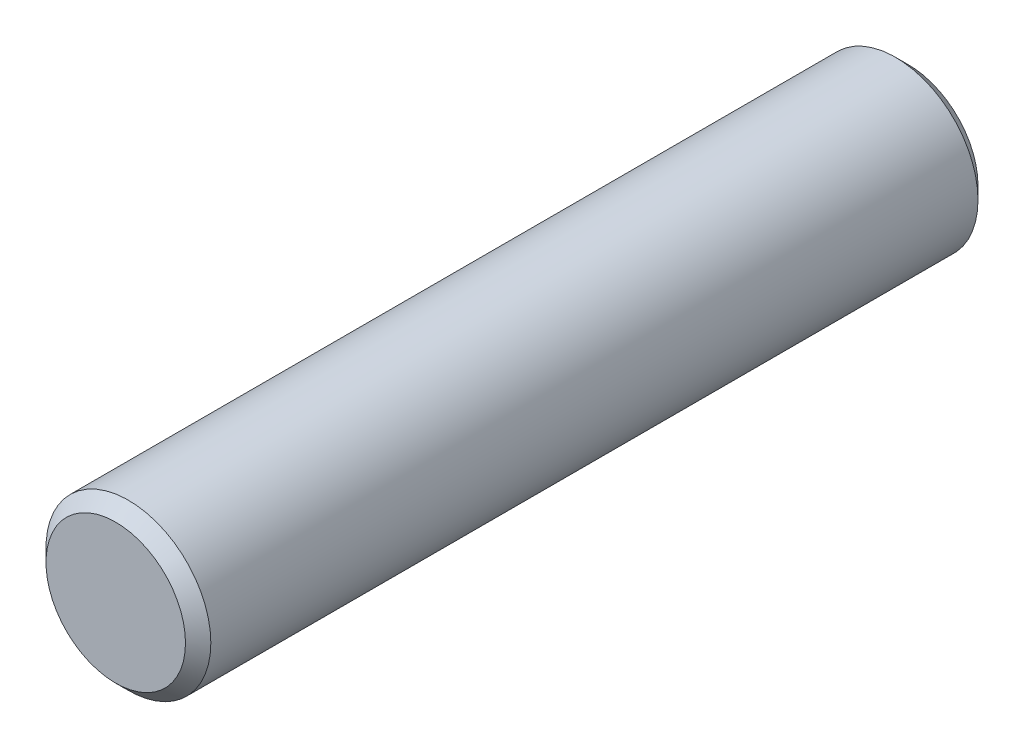
ISO-10303-21;
HEADER;
FILE_DESCRIPTION(('STEP AP214'),'2;1');
FILE_NAME('part.step','',(''),(''),'','','');
FILE_SCHEMA(('AUTOMOTIVE_DESIGN { 1 0 10303 214 1 1 1 1 }'));
ENDSEC;
DATA;
#1=APPLICATION_CONTEXT('core data for automotive mechanical design processes');
#2=APPLICATION_PROTOCOL_DEFINITION('international standard','automotive_design',2000,#1);
#3=PRODUCT_CONTEXT('',#1,'mechanical');
#4=PRODUCT('Part','Part','',(#3));
#5=PRODUCT_RELATED_PRODUCT_CATEGORY('part','',(#4));
#6=PRODUCT_DEFINITION_FORMATION('','',#4);
#7=PRODUCT_DEFINITION_CONTEXT('part definition',#1,'design');
#8=PRODUCT_DEFINITION('design','',#6,#7);
#9=PRODUCT_DEFINITION_SHAPE('','',#8);
#10=(LENGTH_UNIT() NAMED_UNIT(*) SI_UNIT(.MILLI.,.METRE.));
#11=(NAMED_UNIT(*) PLANE_ANGLE_UNIT() SI_UNIT($,.RADIAN.));
#12=(NAMED_UNIT(*) SI_UNIT($,.STERADIAN.) SOLID_ANGLE_UNIT());
#13=UNCERTAINTY_MEASURE_WITH_UNIT(LENGTH_MEASURE(1.E-05),#10,'distance_accuracy_value','');
#14=(GEOMETRIC_REPRESENTATION_CONTEXT(3) GLOBAL_UNCERTAINTY_ASSIGNED_CONTEXT((#13)) GLOBAL_UNIT_ASSIGNED_CONTEXT((#10,
#11,#12)) REPRESENTATION_CONTEXT('',''));
#15=CARTESIAN_POINT('',(0.,0.,0.));
#16=DIRECTION('',(0.,0.,1.));
#17=DIRECTION('',(1.,0.,0.));
#18=AXIS2_PLACEMENT_3D('',#15,#16,#17);
#19=CARTESIAN_POINT('',(0.,0.,7.9375));
#20=DIRECTION('',(0.,0.,-1.));
#21=DIRECTION('',(-1.,0.,0.));
#22=AXIS2_PLACEMENT_3D('',#19,#20,#21);
#23=CYLINDRICAL_SURFACE('',#22,1.651);
#24=CARTESIAN_POINT('',(0.,0.,-7.6835));
#25=DIRECTION('',(0.,0.,1.));
#26=DIRECTION('',(1.,0.,0.));
#27=AXIS2_PLACEMENT_3D('',#24,#25,#26);
#28=CIRCLE('',#27,1.651);
#29=CARTESIAN_POINT('',(1.651,0.,-7.6835));
#30=VERTEX_POINT('',#29);
#31=EDGE_CURVE('E54',#30,#30,#28,.T.);
#32=ORIENTED_EDGE('',*,*,#31,.T.);
#33=EDGE_LOOP('',(#32));
#34=FACE_BOUND('',#33,.T.);
#35=CARTESIAN_POINT('',(0.,0.,7.6835));
#36=DIRECTION('',(0.,0.,1.));
#37=DIRECTION('',(1.,0.,0.));
#38=AXIS2_PLACEMENT_3D('',#35,#36,#37);
#39=CIRCLE('',#38,1.651);
#40=CARTESIAN_POINT('',(1.651,0.,7.6835));
#41=VERTEX_POINT('',#40);
#42=EDGE_CURVE('E60',#41,#41,#39,.F.);
#43=ORIENTED_EDGE('',*,*,#42,.T.);
#44=EDGE_LOOP('',(#43));
#45=FACE_BOUND('',#44,.T.);
#46=ADVANCED_FACE('F39',(#34,#45),#23,.T.);
#47=CARTESIAN_POINT('',(0.,0.,7.9375));
#48=DIRECTION('',(0.,0.,1.));
#49=DIRECTION('',(1.,0.,0.));
#50=AXIS2_PLACEMENT_3D('',#47,#48,#49);
#51=PLANE('',#50);
#52=CARTESIAN_POINT('',(0.,0.,7.9375));
#53=DIRECTION('',(0.,0.,1.));
#54=DIRECTION('',(1.,0.,0.));
#55=AXIS2_PLACEMENT_3D('',#52,#53,#54);
#56=CIRCLE('',#55,1.397);
#57=CARTESIAN_POINT('',(1.397,0.,7.9375));
#58=VERTEX_POINT('',#57);
#59=EDGE_CURVE('E10',#58,#58,#56,.T.);
#60=ORIENTED_EDGE('',*,*,#59,.T.);
#61=EDGE_LOOP('',(#60));
#62=FACE_BOUND('',#61,.T.);
#63=ADVANCED_FACE('F78',(#62),#51,.T.);
#64=CARTESIAN_POINT('',(0.,0.,-7.9375));
#65=DIRECTION('',(0.,0.,1.));
#66=DIRECTION('',(1.,0.,0.));
#67=AXIS2_PLACEMENT_3D('',#64,#65,#66);
#68=PLANE('',#67);
#69=CARTESIAN_POINT('',(0.,0.,-7.9375));
#70=DIRECTION('',(0.,0.,1.));
#71=DIRECTION('',(1.,0.,0.));
#72=AXIS2_PLACEMENT_3D('',#69,#70,#71);
#73=CIRCLE('',#72,1.39699999999999);
#74=CARTESIAN_POINT('',(1.39699999999999,0.,-7.9375));
#75=VERTEX_POINT('',#74);
#76=EDGE_CURVE('E48',#75,#75,#73,.F.);
#77=ORIENTED_EDGE('',*,*,#76,.T.);
#78=EDGE_LOOP('',(#77));
#79=FACE_BOUND('',#78,.T.);
#80=ADVANCED_FACE('F75',(#79),#68,.F.);
#81=CARTESIAN_POINT('',(0.,0.,-7.6835));
#82=DIRECTION('',(0.,0.,1.));
#83=DIRECTION('',(1.,0.,0.));
#84=AXIS2_PLACEMENT_3D('',#81,#82,#83);
#85=CONICAL_SURFACE('',#84,1.651,0.785398163397452);
#86=ORIENTED_EDGE('',*,*,#76,.F.);
#87=EDGE_LOOP('',(#86));
#88=FACE_BOUND('',#87,.T.);
#89=ORIENTED_EDGE('',*,*,#31,.F.);
#90=EDGE_LOOP('',(#89));
#91=FACE_BOUND('',#90,.T.);
#92=ADVANCED_FACE('F71',(#88,#91),#85,.T.);
#93=CARTESIAN_POINT('',(0.,0.,7.9375));
#94=DIRECTION('',(0.,0.,-1.));
#95=DIRECTION('',(-1.,0.,0.));
#96=AXIS2_PLACEMENT_3D('',#93,#94,#95);
#97=CONICAL_SURFACE('',#96,1.397,0.78539816339745);
#98=ORIENTED_EDGE('',*,*,#42,.F.);
#99=EDGE_LOOP('',(#98));
#100=FACE_BOUND('',#99,.T.);
#101=ORIENTED_EDGE('',*,*,#59,.F.);
#102=EDGE_LOOP('',(#101));
#103=FACE_BOUND('',#102,.T.);
#104=ADVANCED_FACE('F42',(#100,#103),#97,.T.);
#105=CLOSED_SHELL('',(#46,#63,#80,#92,#104));
#106=MANIFOLD_SOLID_BREP('B2',#105);
#107=ADVANCED_BREP_SHAPE_REPRESENTATION('',(#18,#106),#14);
#108=SHAPE_DEFINITION_REPRESENTATION(#9,#107);
ENDSEC;
END-ISO-10303-21;
